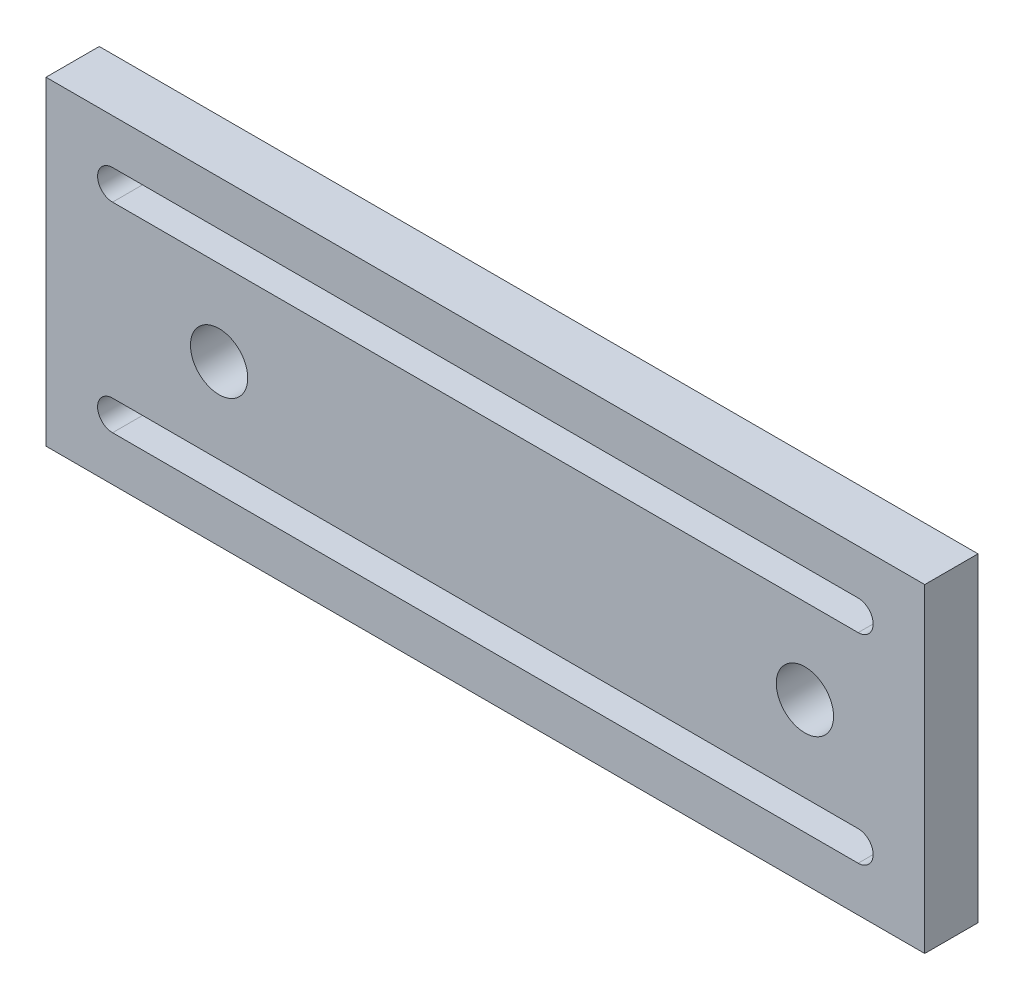
ISO-10303-21;
HEADER;
FILE_DESCRIPTION(('STEP AP214'),'2;1');
FILE_NAME('part.step','',(''),(''),'','','');
FILE_SCHEMA(('AUTOMOTIVE_DESIGN { 1 0 10303 214 1 1 1 1 }'));
ENDSEC;
DATA;
#1=APPLICATION_CONTEXT('core data for automotive mechanical design processes');
#2=APPLICATION_PROTOCOL_DEFINITION('international standard','automotive_design',2000,#1);
#3=PRODUCT_CONTEXT('',#1,'mechanical');
#4=PRODUCT('Part','Part','',(#3));
#5=PRODUCT_RELATED_PRODUCT_CATEGORY('part','',(#4));
#6=PRODUCT_DEFINITION_FORMATION('','',#4);
#7=PRODUCT_DEFINITION_CONTEXT('part definition',#1,'design');
#8=PRODUCT_DEFINITION('design','',#6,#7);
#9=PRODUCT_DEFINITION_SHAPE('','',#8);
#10=(LENGTH_UNIT() NAMED_UNIT(*) SI_UNIT(.MILLI.,.METRE.));
#11=(NAMED_UNIT(*) PLANE_ANGLE_UNIT() SI_UNIT($,.RADIAN.));
#12=(NAMED_UNIT(*) SI_UNIT($,.STERADIAN.) SOLID_ANGLE_UNIT());
#13=UNCERTAINTY_MEASURE_WITH_UNIT(LENGTH_MEASURE(1.E-05),#10,'distance_accuracy_value','');
#14=(GEOMETRIC_REPRESENTATION_CONTEXT(3) GLOBAL_UNCERTAINTY_ASSIGNED_CONTEXT((#13)) GLOBAL_UNIT_ASSIGNED_CONTEXT((#10,
#11,#12)) REPRESENTATION_CONTEXT('',''));
#15=CARTESIAN_POINT('',(0.,0.,0.));
#16=DIRECTION('',(0.,0.,1.));
#17=DIRECTION('',(1.,0.,0.));
#18=AXIS2_PLACEMENT_3D('',#15,#16,#17);
#19=CARTESIAN_POINT('',(0.,0.,8.));
#20=DIRECTION('',(0.,0.,1.));
#21=DIRECTION('',(1.,0.,0.));
#22=AXIS2_PLACEMENT_3D('',#19,#20,#21);
#23=PLANE('',#22);
#24=CARTESIAN_POINT('',(-40.,0.,8.));
#25=DIRECTION('',(0.,0.,1.));
#26=DIRECTION('',(1.,0.,0.));
#27=AXIS2_PLACEMENT_3D('',#24,#25,#26);
#28=CIRCLE('',#27,4.30327539821132);
#29=CARTESIAN_POINT('',(-35.6967246017887,0.,8.));
#30=VERTEX_POINT('',#29);
#31=EDGE_CURVE('E164',#30,#30,#28,.T.);
#32=ORIENTED_EDGE('',*,*,#31,.F.);
#33=EDGE_LOOP('',(#32));
#34=FACE_BOUND('',#33,.T.);
#35=DIRECTION('',(0.,-1.,0.));
#36=VECTOR('',#35,1.);
#37=CARTESIAN_POINT('',(-66.,-24.,8.));
#38=LINE('',#37,#36);
#39=CARTESIAN_POINT('',(-66.,24.,8.));
#40=VERTEX_POINT('',#39);
#41=CARTESIAN_POINT('',(-66.,-24.,8.));
#42=VERTEX_POINT('',#41);
#43=EDGE_CURVE('E201',#40,#42,#38,.T.);
#44=ORIENTED_EDGE('',*,*,#43,.T.);
#45=DIRECTION('',(1.,0.,0.));
#46=VECTOR('',#45,1.);
#47=CARTESIAN_POINT('',(66.,-24.,8.));
#48=LINE('',#47,#46);
#49=CARTESIAN_POINT('',(66.,-24.,8.));
#50=VERTEX_POINT('',#49);
#51=EDGE_CURVE('E204',#42,#50,#48,.T.);
#52=ORIENTED_EDGE('',*,*,#51,.T.);
#53=DIRECTION('',(0.,1.,0.));
#54=VECTOR('',#53,1.);
#55=CARTESIAN_POINT('',(66.,-24.,8.));
#56=LINE('',#55,#54);
#57=CARTESIAN_POINT('',(66.,24.,8.));
#58=VERTEX_POINT('',#57);
#59=EDGE_CURVE('E207',#50,#58,#56,.T.);
#60=ORIENTED_EDGE('',*,*,#59,.T.);
#61=DIRECTION('',(-1.,0.,0.));
#62=VECTOR('',#61,1.);
#63=CARTESIAN_POINT('',(66.,24.,8.));
#64=LINE('',#63,#62);
#65=EDGE_CURVE('E209',#58,#40,#64,.T.);
#66=ORIENTED_EDGE('',*,*,#65,.T.);
#67=EDGE_LOOP('',(#44,#52,#60,#66));
#68=FACE_BOUND('',#67,.T.);
#69=DIRECTION('',(1.,0.,0.));
#70=VECTOR('',#69,1.);
#71=CARTESIAN_POINT('',(56.,12.75,8.));
#72=LINE('',#71,#70);
#73=CARTESIAN_POINT('',(-56.,12.75,8.));
#74=VERTEX_POINT('',#73);
#75=CARTESIAN_POINT('',(56.,12.75,8.));
#76=VERTEX_POINT('',#75);
#77=EDGE_CURVE('E172',#74,#76,#72,.T.);
#78=ORIENTED_EDGE('',*,*,#77,.F.);
#79=CARTESIAN_POINT('',(-56.,15.,8.));
#80=DIRECTION('',(0.,0.,1.));
#81=DIRECTION('',(1.,0.,0.));
#82=AXIS2_PLACEMENT_3D('',#79,#80,#81);
#83=CIRCLE('',#82,2.25);
#84=CARTESIAN_POINT('',(-56.,17.25,8.));
#85=VERTEX_POINT('',#84);
#86=EDGE_CURVE('E170',#85,#74,#83,.T.);
#87=ORIENTED_EDGE('',*,*,#86,.F.);
#88=DIRECTION('',(-1.,0.,0.));
#89=VECTOR('',#88,1.);
#90=CARTESIAN_POINT('',(56.,17.25,8.));
#91=LINE('',#90,#89);
#92=CARTESIAN_POINT('',(56.,17.25,8.));
#93=VERTEX_POINT('',#92);
#94=EDGE_CURVE('E178',#93,#85,#91,.T.);
#95=ORIENTED_EDGE('',*,*,#94,.F.);
#96=CARTESIAN_POINT('',(56.,15.,8.));
#97=DIRECTION('',(0.,0.,1.));
#98=DIRECTION('',(1.,0.,0.));
#99=AXIS2_PLACEMENT_3D('',#96,#97,#98);
#100=CIRCLE('',#99,2.25000000000001);
#101=EDGE_CURVE('E175',#76,#93,#100,.T.);
#102=ORIENTED_EDGE('',*,*,#101,.F.);
#103=EDGE_LOOP('',(#78,#87,#95,#102));
#104=FACE_BOUND('',#103,.T.);
#105=CARTESIAN_POINT('',(48.,0.,8.));
#106=DIRECTION('',(0.,0.,1.));
#107=DIRECTION('',(1.,0.,0.));
#108=AXIS2_PLACEMENT_3D('',#105,#106,#107);
#109=CIRCLE('',#108,4.30327539821132);
#110=CARTESIAN_POINT('',(52.3032753982113,0.,8.));
#111=VERTEX_POINT('',#110);
#112=EDGE_CURVE('E158',#111,#111,#109,.T.);
#113=ORIENTED_EDGE('',*,*,#112,.F.);
#114=EDGE_LOOP('',(#113));
#115=FACE_BOUND('',#114,.T.);
#116=DIRECTION('',(1.,0.,0.));
#117=VECTOR('',#116,1.);
#118=CARTESIAN_POINT('',(-56.,-17.25,8.));
#119=LINE('',#118,#117);
#120=CARTESIAN_POINT('',(-56.,-17.25,8.));
#121=VERTEX_POINT('',#120);
#122=CARTESIAN_POINT('',(56.,-17.25,8.));
#123=VERTEX_POINT('',#122);
#124=EDGE_CURVE('E130',#121,#123,#119,.T.);
#125=ORIENTED_EDGE('',*,*,#124,.F.);
#126=CARTESIAN_POINT('',(-56.,-15.,8.));
#127=DIRECTION('',(0.,0.,1.));
#128=DIRECTION('',(1.,0.,0.));
#129=AXIS2_PLACEMENT_3D('',#126,#127,#128);
#130=CIRCLE('',#129,2.25);
#131=CARTESIAN_POINT('',(-56.,-12.75,8.));
#132=VERTEX_POINT('',#131);
#133=EDGE_CURVE('E122',#132,#121,#130,.T.);
#134=ORIENTED_EDGE('',*,*,#133,.F.);
#135=DIRECTION('',(-1.,0.,0.));
#136=VECTOR('',#135,1.);
#137=CARTESIAN_POINT('',(-56.,-12.75,8.));
#138=LINE('',#137,#136);
#139=CARTESIAN_POINT('',(56.,-12.75,8.));
#140=VERTEX_POINT('',#139);
#141=EDGE_CURVE('E144',#140,#132,#138,.T.);
#142=ORIENTED_EDGE('',*,*,#141,.F.);
#143=CARTESIAN_POINT('',(56.,-15.,8.));
#144=DIRECTION('',(0.,0.,1.));
#145=DIRECTION('',(1.,0.,0.));
#146=AXIS2_PLACEMENT_3D('',#143,#144,#145);
#147=CIRCLE('',#146,2.25);
#148=EDGE_CURVE('E142',#123,#140,#147,.T.);
#149=ORIENTED_EDGE('',*,*,#148,.F.);
#150=EDGE_LOOP('',(#125,#134,#142,#149));
#151=FACE_BOUND('',#150,.T.);
#152=ADVANCED_FACE('F33',(#34,#68,#104,#115,#151),#23,.T.);
#153=CARTESIAN_POINT('',(0.,0.,0.));
#154=DIRECTION('',(0.,0.,1.));
#155=DIRECTION('',(1.,0.,0.));
#156=AXIS2_PLACEMENT_3D('',#153,#154,#155);
#157=PLANE('',#156);
#158=CARTESIAN_POINT('',(48.,0.,0.));
#159=DIRECTION('',(0.,0.,1.));
#160=DIRECTION('',(1.,0.,0.));
#161=AXIS2_PLACEMENT_3D('',#158,#159,#160);
#162=CIRCLE('',#161,4.30327539821132);
#163=CARTESIAN_POINT('',(52.3032753982113,0.,0.));
#164=VERTEX_POINT('',#163);
#165=EDGE_CURVE('E138',#164,#164,#162,.T.);
#166=ORIENTED_EDGE('',*,*,#165,.T.);
#167=EDGE_LOOP('',(#166));
#168=FACE_BOUND('',#167,.T.);
#169=CARTESIAN_POINT('',(-40.,0.,0.));
#170=DIRECTION('',(0.,0.,1.));
#171=DIRECTION('',(1.,0.,0.));
#172=AXIS2_PLACEMENT_3D('',#169,#170,#171);
#173=CIRCLE('',#172,4.30327539821132);
#174=CARTESIAN_POINT('',(-35.6967246017887,0.,0.));
#175=VERTEX_POINT('',#174);
#176=EDGE_CURVE('E161',#175,#175,#173,.T.);
#177=ORIENTED_EDGE('',*,*,#176,.T.);
#178=EDGE_LOOP('',(#177));
#179=FACE_BOUND('',#178,.T.);
#180=CARTESIAN_POINT('',(-56.,15.,0.));
#181=DIRECTION('',(0.,0.,1.));
#182=DIRECTION('',(1.,0.,0.));
#183=AXIS2_PLACEMENT_3D('',#180,#181,#182);
#184=CIRCLE('',#183,2.25);
#185=CARTESIAN_POINT('',(-56.,17.25,0.));
#186=VERTEX_POINT('',#185);
#187=CARTESIAN_POINT('',(-56.,12.75,0.));
#188=VERTEX_POINT('',#187);
#189=EDGE_CURVE('E167',#186,#188,#184,.T.);
#190=ORIENTED_EDGE('',*,*,#189,.T.);
#191=DIRECTION('',(1.,0.,0.));
#192=VECTOR('',#191,1.);
#193=CARTESIAN_POINT('',(56.,12.75,0.));
#194=LINE('',#193,#192);
#195=CARTESIAN_POINT('',(56.,12.75,0.));
#196=VERTEX_POINT('',#195);
#197=EDGE_CURVE('E183',#188,#196,#194,.T.);
#198=ORIENTED_EDGE('',*,*,#197,.T.);
#199=CARTESIAN_POINT('',(56.,15.,0.));
#200=DIRECTION('',(0.,0.,1.));
#201=DIRECTION('',(1.,0.,0.));
#202=AXIS2_PLACEMENT_3D('',#199,#200,#201);
#203=CIRCLE('',#202,2.25000000000001);
#204=CARTESIAN_POINT('',(56.,17.25,0.));
#205=VERTEX_POINT('',#204);
#206=EDGE_CURVE('E186',#196,#205,#203,.T.);
#207=ORIENTED_EDGE('',*,*,#206,.T.);
#208=DIRECTION('',(-1.,0.,0.));
#209=VECTOR('',#208,1.);
#210=CARTESIAN_POINT('',(56.,17.25,0.));
#211=LINE('',#210,#209);
#212=EDGE_CURVE('E173',#205,#186,#211,.T.);
#213=ORIENTED_EDGE('',*,*,#212,.T.);
#214=EDGE_LOOP('',(#190,#198,#207,#213));
#215=FACE_BOUND('',#214,.T.);
#216=DIRECTION('',(0.,-1.,0.));
#217=VECTOR('',#216,1.);
#218=CARTESIAN_POINT('',(-66.,-24.,0.));
#219=LINE('',#218,#217);
#220=CARTESIAN_POINT('',(-66.,24.,0.));
#221=VERTEX_POINT('',#220);
#222=CARTESIAN_POINT('',(-66.,-24.,0.));
#223=VERTEX_POINT('',#222);
#224=EDGE_CURVE('E200',#221,#223,#219,.T.);
#225=ORIENTED_EDGE('',*,*,#224,.F.);
#226=DIRECTION('',(-1.,0.,0.));
#227=VECTOR('',#226,1.);
#228=CARTESIAN_POINT('',(66.,24.,0.));
#229=LINE('',#228,#227);
#230=CARTESIAN_POINT('',(66.,24.,0.));
#231=VERTEX_POINT('',#230);
#232=EDGE_CURVE('E205',#231,#221,#229,.T.);
#233=ORIENTED_EDGE('',*,*,#232,.F.);
#234=DIRECTION('',(0.,1.,0.));
#235=VECTOR('',#234,1.);
#236=CARTESIAN_POINT('',(66.,-24.,0.));
#237=LINE('',#236,#235);
#238=CARTESIAN_POINT('',(66.,-24.,0.));
#239=VERTEX_POINT('',#238);
#240=EDGE_CURVE('E216',#239,#231,#237,.T.);
#241=ORIENTED_EDGE('',*,*,#240,.F.);
#242=DIRECTION('',(1.,0.,0.));
#243=VECTOR('',#242,1.);
#244=CARTESIAN_POINT('',(66.,-24.,0.));
#245=LINE('',#244,#243);
#246=EDGE_CURVE('E214',#223,#239,#245,.T.);
#247=ORIENTED_EDGE('',*,*,#246,.F.);
#248=EDGE_LOOP('',(#225,#233,#241,#247));
#249=FACE_BOUND('',#248,.T.);
#250=CARTESIAN_POINT('',(-56.,-15.,0.));
#251=DIRECTION('',(0.,0.,1.));
#252=DIRECTION('',(1.,0.,0.));
#253=AXIS2_PLACEMENT_3D('',#250,#251,#252);
#254=CIRCLE('',#253,2.25);
#255=CARTESIAN_POINT('',(-56.,-12.75,0.));
#256=VERTEX_POINT('',#255);
#257=CARTESIAN_POINT('',(-56.,-17.25,0.));
#258=VERTEX_POINT('',#257);
#259=EDGE_CURVE('E56',#256,#258,#254,.T.);
#260=ORIENTED_EDGE('',*,*,#259,.T.);
#261=DIRECTION('',(1.,0.,0.));
#262=VECTOR('',#261,1.);
#263=CARTESIAN_POINT('',(-56.,-17.25,0.));
#264=LINE('',#263,#262);
#265=CARTESIAN_POINT('',(56.,-17.25,0.));
#266=VERTEX_POINT('',#265);
#267=EDGE_CURVE('E137',#258,#266,#264,.T.);
#268=ORIENTED_EDGE('',*,*,#267,.T.);
#269=CARTESIAN_POINT('',(56.,-15.,0.));
#270=DIRECTION('',(0.,0.,1.));
#271=DIRECTION('',(1.,0.,0.));
#272=AXIS2_PLACEMENT_3D('',#269,#270,#271);
#273=CIRCLE('',#272,2.25);
#274=CARTESIAN_POINT('',(56.,-12.75,0.));
#275=VERTEX_POINT('',#274);
#276=EDGE_CURVE('E150',#266,#275,#273,.T.);
#277=ORIENTED_EDGE('',*,*,#276,.T.);
#278=DIRECTION('',(-1.,0.,0.));
#279=VECTOR('',#278,1.);
#280=CARTESIAN_POINT('',(-56.,-12.75,0.));
#281=LINE('',#280,#279);
#282=EDGE_CURVE('E131',#275,#256,#281,.T.);
#283=ORIENTED_EDGE('',*,*,#282,.T.);
#284=EDGE_LOOP('',(#260,#268,#277,#283));
#285=FACE_BOUND('',#284,.T.);
#286=ADVANCED_FACE('F234',(#168,#179,#215,#249,#285),#157,.F.);
#287=CARTESIAN_POINT('',(-66.,-24.,8.));
#288=DIRECTION('',(1.,0.,0.));
#289=DIRECTION('',(0.,0.,-1.));
#290=AXIS2_PLACEMENT_3D('',#287,#288,#289);
#291=PLANE('',#290);
#292=ORIENTED_EDGE('',*,*,#224,.T.);
#293=DIRECTION('',(0.,0.,-1.));
#294=VECTOR('',#293,1.);
#295=CARTESIAN_POINT('',(-66.,-24.,8.));
#296=LINE('',#295,#294);
#297=EDGE_CURVE('E11',#42,#223,#296,.T.);
#298=ORIENTED_EDGE('',*,*,#297,.F.);
#299=ORIENTED_EDGE('',*,*,#43,.F.);
#300=DIRECTION('',(0.,0.,-1.));
#301=VECTOR('',#300,1.);
#302=CARTESIAN_POINT('',(-66.,24.,8.));
#303=LINE('',#302,#301);
#304=EDGE_CURVE('E211',#40,#221,#303,.T.);
#305=ORIENTED_EDGE('',*,*,#304,.T.);
#306=EDGE_LOOP('',(#292,#298,#299,#305));
#307=FACE_BOUND('',#306,.T.);
#308=ADVANCED_FACE('F35',(#307),#291,.F.);
#309=CARTESIAN_POINT('',(66.,-24.,8.));
#310=DIRECTION('',(0.,1.,0.));
#311=DIRECTION('',(-1.,0.,0.));
#312=AXIS2_PLACEMENT_3D('',#309,#310,#311);
#313=PLANE('',#312);
#314=ORIENTED_EDGE('',*,*,#246,.T.);
#315=DIRECTION('',(0.,0.,-1.));
#316=VECTOR('',#315,1.);
#317=CARTESIAN_POINT('',(66.,-24.,8.));
#318=LINE('',#317,#316);
#319=EDGE_CURVE('E41',#50,#239,#318,.T.);
#320=ORIENTED_EDGE('',*,*,#319,.F.);
#321=ORIENTED_EDGE('',*,*,#51,.F.);
#322=ORIENTED_EDGE('',*,*,#297,.T.);
#323=EDGE_LOOP('',(#314,#320,#321,#322));
#324=FACE_BOUND('',#323,.T.);
#325=ADVANCED_FACE('F245',(#324),#313,.F.);
#326=CARTESIAN_POINT('',(66.,-24.,8.));
#327=DIRECTION('',(-1.,0.,0.));
#328=DIRECTION('',(0.,0.,1.));
#329=AXIS2_PLACEMENT_3D('',#326,#327,#328);
#330=PLANE('',#329);
#331=ORIENTED_EDGE('',*,*,#240,.T.);
#332=DIRECTION('',(0.,0.,-1.));
#333=VECTOR('',#332,1.);
#334=CARTESIAN_POINT('',(66.,24.,8.));
#335=LINE('',#334,#333);
#336=EDGE_CURVE('E221',#58,#231,#335,.T.);
#337=ORIENTED_EDGE('',*,*,#336,.F.);
#338=ORIENTED_EDGE('',*,*,#59,.F.);
#339=ORIENTED_EDGE('',*,*,#319,.T.);
#340=EDGE_LOOP('',(#331,#337,#338,#339));
#341=FACE_BOUND('',#340,.T.);
#342=ADVANCED_FACE('F228',(#341),#330,.F.);
#343=CARTESIAN_POINT('',(66.,24.,8.));
#344=DIRECTION('',(0.,-1.,0.));
#345=DIRECTION('',(1.,0.,0.));
#346=AXIS2_PLACEMENT_3D('',#343,#344,#345);
#347=PLANE('',#346);
#348=ORIENTED_EDGE('',*,*,#232,.T.);
#349=ORIENTED_EDGE('',*,*,#304,.F.);
#350=ORIENTED_EDGE('',*,*,#65,.F.);
#351=ORIENTED_EDGE('',*,*,#336,.T.);
#352=EDGE_LOOP('',(#348,#349,#350,#351));
#353=FACE_BOUND('',#352,.T.);
#354=ADVANCED_FACE('F238',(#353),#347,.F.);
#355=CARTESIAN_POINT('',(-56.,15.,8.));
#356=DIRECTION('',(0.,0.,-1.));
#357=DIRECTION('',(-1.,0.,0.));
#358=AXIS2_PLACEMENT_3D('',#355,#356,#357);
#359=CYLINDRICAL_SURFACE('',#358,2.25);
#360=ORIENTED_EDGE('',*,*,#189,.F.);
#361=DIRECTION('',(0.,0.,-1.));
#362=VECTOR('',#361,1.);
#363=CARTESIAN_POINT('',(-56.,17.25,8.));
#364=LINE('',#363,#362);
#365=EDGE_CURVE('E180',#85,#186,#364,.T.);
#366=ORIENTED_EDGE('',*,*,#365,.F.);
#367=ORIENTED_EDGE('',*,*,#86,.T.);
#368=DIRECTION('',(0.,0.,-1.));
#369=VECTOR('',#368,1.);
#370=CARTESIAN_POINT('',(-56.,12.75,8.));
#371=LINE('',#370,#369);
#372=EDGE_CURVE('E197',#74,#188,#371,.T.);
#373=ORIENTED_EDGE('',*,*,#372,.T.);
#374=EDGE_LOOP('',(#360,#366,#367,#373));
#375=FACE_BOUND('',#374,.T.);
#376=ADVANCED_FACE('F262',(#375),#359,.F.);
#377=CARTESIAN_POINT('',(56.,12.75,8.));
#378=DIRECTION('',(0.,1.,0.));
#379=DIRECTION('',(-1.,0.,0.));
#380=AXIS2_PLACEMENT_3D('',#377,#378,#379);
#381=PLANE('',#380);
#382=ORIENTED_EDGE('',*,*,#197,.F.);
#383=ORIENTED_EDGE('',*,*,#372,.F.);
#384=ORIENTED_EDGE('',*,*,#77,.T.);
#385=DIRECTION('',(0.,0.,-1.));
#386=VECTOR('',#385,1.);
#387=CARTESIAN_POINT('',(56.,12.75,8.));
#388=LINE('',#387,#386);
#389=EDGE_CURVE('E195',#76,#196,#388,.T.);
#390=ORIENTED_EDGE('',*,*,#389,.T.);
#391=EDGE_LOOP('',(#382,#383,#384,#390));
#392=FACE_BOUND('',#391,.T.);
#393=ADVANCED_FACE('F269',(#392),#381,.T.);
#394=CARTESIAN_POINT('',(56.,15.,8.));
#395=DIRECTION('',(0.,0.,-1.));
#396=DIRECTION('',(-1.,0.,0.));
#397=AXIS2_PLACEMENT_3D('',#394,#395,#396);
#398=CYLINDRICAL_SURFACE('',#397,2.25000000000001);
#399=ORIENTED_EDGE('',*,*,#206,.F.);
#400=ORIENTED_EDGE('',*,*,#389,.F.);
#401=ORIENTED_EDGE('',*,*,#101,.T.);
#402=DIRECTION('',(0.,0.,-1.));
#403=VECTOR('',#402,1.);
#404=CARTESIAN_POINT('',(56.,17.25,8.));
#405=LINE('',#404,#403);
#406=EDGE_CURVE('E193',#93,#205,#405,.T.);
#407=ORIENTED_EDGE('',*,*,#406,.T.);
#408=EDGE_LOOP('',(#399,#400,#401,#407));
#409=FACE_BOUND('',#408,.T.);
#410=ADVANCED_FACE('F274',(#409),#398,.F.);
#411=CARTESIAN_POINT('',(56.,17.25,8.));
#412=DIRECTION('',(0.,-1.,0.));
#413=DIRECTION('',(1.,0.,0.));
#414=AXIS2_PLACEMENT_3D('',#411,#412,#413);
#415=PLANE('',#414);
#416=ORIENTED_EDGE('',*,*,#212,.F.);
#417=ORIENTED_EDGE('',*,*,#406,.F.);
#418=ORIENTED_EDGE('',*,*,#94,.T.);
#419=ORIENTED_EDGE('',*,*,#365,.T.);
#420=EDGE_LOOP('',(#416,#417,#418,#419));
#421=FACE_BOUND('',#420,.T.);
#422=ADVANCED_FACE('F282',(#421),#415,.T.);
#423=CARTESIAN_POINT('',(-40.,0.,8.));
#424=DIRECTION('',(0.,0.,-1.));
#425=DIRECTION('',(-1.,0.,0.));
#426=AXIS2_PLACEMENT_3D('',#423,#424,#425);
#427=CYLINDRICAL_SURFACE('',#426,4.30327539821132);
#428=ORIENTED_EDGE('',*,*,#31,.T.);
#429=EDGE_LOOP('',(#428));
#430=FACE_BOUND('',#429,.T.);
#431=ORIENTED_EDGE('',*,*,#176,.F.);
#432=EDGE_LOOP('',(#431));
#433=FACE_BOUND('',#432,.T.);
#434=ADVANCED_FACE('F295',(#430,#433),#427,.F.);
#435=CARTESIAN_POINT('',(48.,0.,8.));
#436=DIRECTION('',(0.,0.,-1.));
#437=DIRECTION('',(-1.,0.,0.));
#438=AXIS2_PLACEMENT_3D('',#435,#436,#437);
#439=CYLINDRICAL_SURFACE('',#438,4.30327539821132);
#440=ORIENTED_EDGE('',*,*,#112,.T.);
#441=EDGE_LOOP('',(#440));
#442=FACE_BOUND('',#441,.T.);
#443=ORIENTED_EDGE('',*,*,#165,.F.);
#444=EDGE_LOOP('',(#443));
#445=FACE_BOUND('',#444,.T.);
#446=ADVANCED_FACE('F292',(#442,#445),#439,.F.);
#447=CARTESIAN_POINT('',(-56.,-15.,8.));
#448=DIRECTION('',(0.,0.,-1.));
#449=DIRECTION('',(-1.,0.,0.));
#450=AXIS2_PLACEMENT_3D('',#447,#448,#449);
#451=CYLINDRICAL_SURFACE('',#450,2.25);
#452=ORIENTED_EDGE('',*,*,#259,.F.);
#453=DIRECTION('',(0.,0.,-1.));
#454=VECTOR('',#453,1.);
#455=CARTESIAN_POINT('',(-56.,-12.75,8.));
#456=LINE('',#455,#454);
#457=EDGE_CURVE('E126',#132,#256,#456,.T.);
#458=ORIENTED_EDGE('',*,*,#457,.F.);
#459=ORIENTED_EDGE('',*,*,#133,.T.);
#460=DIRECTION('',(0.,0.,-1.));
#461=VECTOR('',#460,1.);
#462=CARTESIAN_POINT('',(-56.,-17.25,8.));
#463=LINE('',#462,#461);
#464=EDGE_CURVE('E125',#121,#258,#463,.T.);
#465=ORIENTED_EDGE('',*,*,#464,.T.);
#466=EDGE_LOOP('',(#452,#458,#459,#465));
#467=FACE_BOUND('',#466,.T.);
#468=ADVANCED_FACE('F124',(#467),#451,.F.);
#469=CARTESIAN_POINT('',(-56.,-17.25,8.));
#470=DIRECTION('',(0.,1.,0.));
#471=DIRECTION('',(0.,0.,1.));
#472=AXIS2_PLACEMENT_3D('',#469,#470,#471);
#473=PLANE('',#472);
#474=ORIENTED_EDGE('',*,*,#267,.F.);
#475=ORIENTED_EDGE('',*,*,#464,.F.);
#476=ORIENTED_EDGE('',*,*,#124,.T.);
#477=DIRECTION('',(0.,0.,-1.));
#478=VECTOR('',#477,1.);
#479=CARTESIAN_POINT('',(56.,-17.25,8.));
#480=LINE('',#479,#478);
#481=EDGE_CURVE('E139',#123,#266,#480,.T.);
#482=ORIENTED_EDGE('',*,*,#481,.T.);
#483=EDGE_LOOP('',(#474,#475,#476,#482));
#484=FACE_BOUND('',#483,.T.);
#485=ADVANCED_FACE('F134',(#484),#473,.T.);
#486=CARTESIAN_POINT('',(56.,-15.,8.));
#487=DIRECTION('',(0.,0.,-1.));
#488=DIRECTION('',(-1.,0.,0.));
#489=AXIS2_PLACEMENT_3D('',#486,#487,#488);
#490=CYLINDRICAL_SURFACE('',#489,2.25);
#491=ORIENTED_EDGE('',*,*,#276,.F.);
#492=ORIENTED_EDGE('',*,*,#481,.F.);
#493=ORIENTED_EDGE('',*,*,#148,.T.);
#494=DIRECTION('',(0.,0.,-1.));
#495=VECTOR('',#494,1.);
#496=CARTESIAN_POINT('',(56.,-12.75,8.));
#497=LINE('',#496,#495);
#498=EDGE_CURVE('E48',#140,#275,#497,.T.);
#499=ORIENTED_EDGE('',*,*,#498,.T.);
#500=EDGE_LOOP('',(#491,#492,#493,#499));
#501=FACE_BOUND('',#500,.T.);
#502=ADVANCED_FACE('F345',(#501),#490,.F.);
#503=CARTESIAN_POINT('',(-56.,-12.75,8.));
#504=DIRECTION('',(0.,-1.,0.));
#505=DIRECTION('',(0.,0.,-1.));
#506=AXIS2_PLACEMENT_3D('',#503,#504,#505);
#507=PLANE('',#506);
#508=ORIENTED_EDGE('',*,*,#282,.F.);
#509=ORIENTED_EDGE('',*,*,#498,.F.);
#510=ORIENTED_EDGE('',*,*,#141,.T.);
#511=ORIENTED_EDGE('',*,*,#457,.T.);
#512=EDGE_LOOP('',(#508,#509,#510,#511));
#513=FACE_BOUND('',#512,.T.);
#514=ADVANCED_FACE('F354',(#513),#507,.T.);
#515=CLOSED_SHELL('',(#152,#286,#308,#325,#342,#354,#376,#393,#410,#422,#434,#446,#468,#485,
#502,#514));
#516=MANIFOLD_SOLID_BREP('B2',#515);
#517=ADVANCED_BREP_SHAPE_REPRESENTATION('',(#18,#516),#14);
#518=SHAPE_DEFINITION_REPRESENTATION(#9,#517);
ENDSEC;
END-ISO-10303-21;
